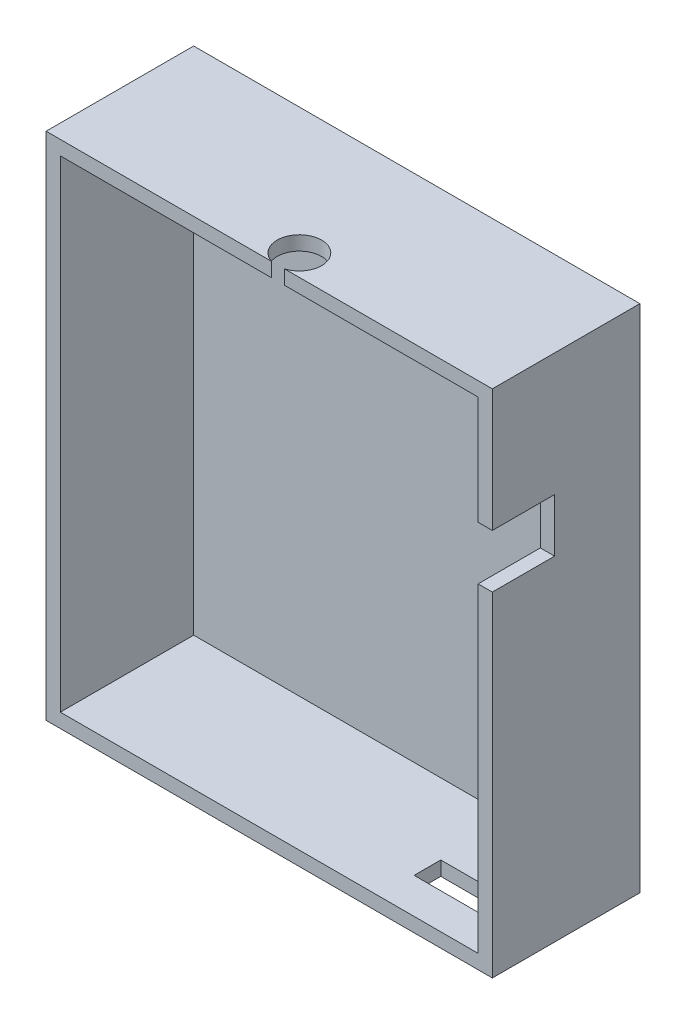
ISO-10303-21;
HEADER;
FILE_DESCRIPTION(('STEP AP214'),'2;1');
FILE_NAME('part.step','',(''),(''),'','','');
FILE_SCHEMA(('AUTOMOTIVE_DESIGN { 1 0 10303 214 1 1 1 1 }'));
ENDSEC;
DATA;
#1=APPLICATION_CONTEXT('core data for automotive mechanical design processes');
#2=APPLICATION_PROTOCOL_DEFINITION('international standard','automotive_design',2000,#1);
#3=PRODUCT_CONTEXT('',#1,'mechanical');
#4=PRODUCT('Part','Part','',(#3));
#5=PRODUCT_RELATED_PRODUCT_CATEGORY('part','',(#4));
#6=PRODUCT_DEFINITION_FORMATION('','',#4);
#7=PRODUCT_DEFINITION_CONTEXT('part definition',#1,'design');
#8=PRODUCT_DEFINITION('design','',#6,#7);
#9=PRODUCT_DEFINITION_SHAPE('','',#8);
#10=(LENGTH_UNIT() NAMED_UNIT(*) SI_UNIT(.MILLI.,.METRE.));
#11=(NAMED_UNIT(*) PLANE_ANGLE_UNIT() SI_UNIT($,.RADIAN.));
#12=(NAMED_UNIT(*) SI_UNIT($,.STERADIAN.) SOLID_ANGLE_UNIT());
#13=UNCERTAINTY_MEASURE_WITH_UNIT(LENGTH_MEASURE(1.E-05),#10,'distance_accuracy_value','');
#14=(GEOMETRIC_REPRESENTATION_CONTEXT(3) GLOBAL_UNCERTAINTY_ASSIGNED_CONTEXT((#13)) GLOBAL_UNIT_ASSIGNED_CONTEXT((#10,
#11,#12)) REPRESENTATION_CONTEXT('',''));
#15=CARTESIAN_POINT('',(0.,0.,0.));
#16=DIRECTION('',(0.,0.,1.));
#17=DIRECTION('',(1.,0.,0.));
#18=AXIS2_PLACEMENT_3D('',#15,#16,#17);
#19=CARTESIAN_POINT('',(0.,0.,16.6));
#20=DIRECTION('',(0.,0.,-1.));
#21=DIRECTION('',(-1.,0.,0.));
#22=AXIS2_PLACEMENT_3D('',#19,#20,#21);
#23=PLANE('',#22);
#24=DIRECTION('',(-1.,0.,0.));
#25=VECTOR('',#24,1.);
#26=CARTESIAN_POINT('',(0.,21.1982532751092,16.6));
#27=LINE('',#26,#25);
#28=CARTESIAN_POINT('',(25.3782131545931,21.1982532751092,16.6));
#29=VERTEX_POINT('',#28);
#30=CARTESIAN_POINT('',(1.6,21.1982532751092,16.6));
#31=VERTEX_POINT('',#30);
#32=EDGE_CURVE('E245',#29,#31,#27,.T.);
#33=ORIENTED_EDGE('',*,*,#32,.F.);
#34=DIRECTION('',(0.,1.,0.));
#35=VECTOR('',#34,1.);
#36=CARTESIAN_POINT('',(25.3782131545931,6.19825327510917,16.6));
#37=LINE('',#36,#35);
#38=CARTESIAN_POINT('',(25.3782131545931,22.7982532751092,16.6));
#39=VERTEX_POINT('',#38);
#40=EDGE_CURVE('E50',#29,#39,#37,.T.);
#41=ORIENTED_EDGE('',*,*,#40,.T.);
#42=DIRECTION('',(-1.,0.,0.));
#43=VECTOR('',#42,1.);
#44=CARTESIAN_POINT('',(0.,22.7982532751092,16.6));
#45=LINE('',#44,#43);
#46=CARTESIAN_POINT('',(0.,22.7982532751092,16.6));
#47=VERTEX_POINT('',#46);
#48=EDGE_CURVE('E174',#39,#47,#45,.T.);
#49=ORIENTED_EDGE('',*,*,#48,.T.);
#50=DIRECTION('',(0.,-1.,0.));
#51=VECTOR('',#50,1.);
#52=CARTESIAN_POINT('',(0.,-34.6017467248908,16.6));
#53=LINE('',#52,#51);
#54=CARTESIAN_POINT('',(0.,-34.6017467248908,16.6));
#55=VERTEX_POINT('',#54);
#56=EDGE_CURVE('E198',#47,#55,#53,.T.);
#57=ORIENTED_EDGE('',*,*,#56,.T.);
#58=DIRECTION('',(1.,0.,0.));
#59=VECTOR('',#58,1.);
#60=CARTESIAN_POINT('',(0.,-34.6017467248908,16.6));
#61=LINE('',#60,#59);
#62=CARTESIAN_POINT('',(50.2,-34.6017467248908,16.6));
#63=VERTEX_POINT('',#62);
#64=EDGE_CURVE('E256',#55,#63,#61,.T.);
#65=ORIENTED_EDGE('',*,*,#64,.T.);
#66=DIRECTION('',(0.,1.,0.));
#67=VECTOR('',#66,1.);
#68=CARTESIAN_POINT('',(50.2,-34.6017467248908,16.6));
#69=LINE('',#68,#67);
#70=CARTESIAN_POINT('',(50.2,2.99825327510917,16.6));
#71=VERTEX_POINT('',#70);
#72=EDGE_CURVE('E185',#63,#71,#69,.T.);
#73=ORIENTED_EDGE('',*,*,#72,.T.);
#74=DIRECTION('',(-1.,0.,0.));
#75=VECTOR('',#74,1.);
#76=CARTESIAN_POINT('',(0.,2.99825327510917,16.6));
#77=LINE('',#76,#75);
#78=CARTESIAN_POINT('',(48.6,2.99825327510917,16.6));
#79=VERTEX_POINT('',#78);
#80=EDGE_CURVE('E225',#71,#79,#77,.T.);
#81=ORIENTED_EDGE('',*,*,#80,.T.);
#82=DIRECTION('',(0.,1.,0.));
#83=VECTOR('',#82,1.);
#84=CARTESIAN_POINT('',(48.6,0.,16.6));
#85=LINE('',#84,#83);
#86=CARTESIAN_POINT('',(48.6,-33.0017467248908,16.6));
#87=VERTEX_POINT('',#86);
#88=EDGE_CURVE('E236',#87,#79,#85,.T.);
#89=ORIENTED_EDGE('',*,*,#88,.F.);
#90=DIRECTION('',(1.,0.,0.));
#91=VECTOR('',#90,1.);
#92=CARTESIAN_POINT('',(0.,-33.0017467248908,16.6));
#93=LINE('',#92,#91);
#94=CARTESIAN_POINT('',(1.6,-33.0017467248908,16.6));
#95=VERTEX_POINT('',#94);
#96=EDGE_CURVE('E250',#95,#87,#93,.T.);
#97=ORIENTED_EDGE('',*,*,#96,.F.);
#98=DIRECTION('',(0.,-1.,0.));
#99=VECTOR('',#98,1.);
#100=CARTESIAN_POINT('',(1.6,0.,16.6));
#101=LINE('',#100,#99);
#102=EDGE_CURVE('E314',#31,#95,#101,.T.);
#103=ORIENTED_EDGE('',*,*,#102,.F.);
#104=EDGE_LOOP('',(#33,#41,#49,#57,#65,#73,#81,#89,#97,#103));
#105=FACE_BOUND('',#104,.T.);
#106=ADVANCED_FACE('F36',(#105),#23,.F.);
#107=CARTESIAN_POINT('',(50.2,22.7982532751092,16.6));
#108=VERTEX_POINT('',#107);
#109=CARTESIAN_POINT('',(26.8217868454069,22.7982532751092,16.6));
#110=VERTEX_POINT('',#109);
#111=EDGE_CURVE('E172',#108,#110,#45,.T.);
#112=ORIENTED_EDGE('',*,*,#111,.T.);
#113=DIRECTION('',(0.,1.,0.));
#114=VECTOR('',#113,1.);
#115=CARTESIAN_POINT('',(26.8217868454069,6.19825327510917,16.6));
#116=LINE('',#115,#114);
#117=CARTESIAN_POINT('',(26.8217868454069,21.1982532751092,16.6));
#118=VERTEX_POINT('',#117);
#119=EDGE_CURVE('E158',#110,#118,#116,.F.);
#120=ORIENTED_EDGE('',*,*,#119,.T.);
#121=CARTESIAN_POINT('',(48.6,21.1982532751092,16.6));
#122=VERTEX_POINT('',#121);
#123=EDGE_CURVE('E248',#122,#118,#27,.T.);
#124=ORIENTED_EDGE('',*,*,#123,.F.);
#125=CARTESIAN_POINT('',(48.6,8.99825327510917,16.6));
#126=VERTEX_POINT('',#125);
#127=EDGE_CURVE('E246',#126,#122,#85,.T.);
#128=ORIENTED_EDGE('',*,*,#127,.F.);
#129=DIRECTION('',(1.,0.,0.));
#130=VECTOR('',#129,1.);
#131=CARTESIAN_POINT('',(0.,8.99825327510917,16.6));
#132=LINE('',#131,#130);
#133=CARTESIAN_POINT('',(50.2,8.99825327510917,16.6));
#134=VERTEX_POINT('',#133);
#135=EDGE_CURVE('E58',#126,#134,#132,.T.);
#136=ORIENTED_EDGE('',*,*,#135,.T.);
#137=EDGE_CURVE('E178',#134,#108,#69,.T.);
#138=ORIENTED_EDGE('',*,*,#137,.T.);
#139=EDGE_LOOP('',(#112,#120,#124,#128,#136,#138));
#140=FACE_BOUND('',#139,.T.);
#141=ADVANCED_FACE('F176',(#140),#23,.F.);
#142=CARTESIAN_POINT('',(0.,-34.6017467248908,16.6));
#143=DIRECTION('',(1.,0.,0.));
#144=DIRECTION('',(0.,0.,-1.));
#145=AXIS2_PLACEMENT_3D('',#142,#143,#144);
#146=PLANE('',#145);
#147=DIRECTION('',(0.,-1.,0.));
#148=VECTOR('',#147,1.);
#149=CARTESIAN_POINT('',(0.,-34.6017467248908,0.));
#150=LINE('',#149,#148);
#151=CARTESIAN_POINT('',(0.,22.7982532751092,0.));
#152=VERTEX_POINT('',#151);
#153=CARTESIAN_POINT('',(0.,-34.6017467248908,0.));
#154=VERTEX_POINT('',#153);
#155=EDGE_CURVE('E189',#152,#154,#150,.T.);
#156=ORIENTED_EDGE('',*,*,#155,.T.);
#157=DIRECTION('',(0.,0.,-1.));
#158=VECTOR('',#157,1.);
#159=CARTESIAN_POINT('',(0.,-34.6017467248908,16.6));
#160=LINE('',#159,#158);
#161=EDGE_CURVE('E204',#55,#154,#160,.T.);
#162=ORIENTED_EDGE('',*,*,#161,.F.);
#163=ORIENTED_EDGE('',*,*,#56,.F.);
#164=DIRECTION('',(0.,0.,-1.));
#165=VECTOR('',#164,1.);
#166=CARTESIAN_POINT('',(0.,22.7982532751092,16.6));
#167=LINE('',#166,#165);
#168=EDGE_CURVE('E180',#47,#152,#167,.T.);
#169=ORIENTED_EDGE('',*,*,#168,.T.);
#170=EDGE_LOOP('',(#156,#162,#163,#169));
#171=FACE_BOUND('',#170,.T.);
#172=ADVANCED_FACE('F38',(#171),#146,.F.);
#173=CARTESIAN_POINT('',(0.,-34.6017467248908,16.6));
#174=DIRECTION('',(0.,1.,0.));
#175=DIRECTION('',(0.,0.,1.));
#176=AXIS2_PLACEMENT_3D('',#173,#174,#175);
#177=PLANE('',#176);
#178=DIRECTION('',(1.,0.,0.));
#179=VECTOR('',#178,1.);
#180=CARTESIAN_POINT('',(37.4,-34.6017467248908,9.6));
#181=LINE('',#180,#179);
#182=CARTESIAN_POINT('',(37.4,-34.6017467248908,9.6));
#183=VERTEX_POINT('',#182);
#184=CARTESIAN_POINT('',(46.,-34.6017467248908,9.6));
#185=VERTEX_POINT('',#184);
#186=EDGE_CURVE('E280',#183,#185,#181,.T.);
#187=ORIENTED_EDGE('',*,*,#186,.F.);
#188=DIRECTION('',(0.,0.,-1.));
#189=VECTOR('',#188,1.);
#190=CARTESIAN_POINT('',(37.4,-34.6017467248908,12.6));
#191=LINE('',#190,#189);
#192=CARTESIAN_POINT('',(37.4,-34.6017467248908,12.6));
#193=VERTEX_POINT('',#192);
#194=EDGE_CURVE('E238',#193,#183,#191,.T.);
#195=ORIENTED_EDGE('',*,*,#194,.F.);
#196=DIRECTION('',(-1.,0.,0.));
#197=VECTOR('',#196,1.);
#198=CARTESIAN_POINT('',(37.4,-34.6017467248908,12.6));
#199=LINE('',#198,#197);
#200=CARTESIAN_POINT('',(46.,-34.6017467248908,12.6));
#201=VERTEX_POINT('',#200);
#202=EDGE_CURVE('E286',#201,#193,#199,.T.);
#203=ORIENTED_EDGE('',*,*,#202,.F.);
#204=DIRECTION('',(0.,0.,1.));
#205=VECTOR('',#204,1.);
#206=CARTESIAN_POINT('',(46.,-34.6017467248908,12.6));
#207=LINE('',#206,#205);
#208=EDGE_CURVE('E283',#185,#201,#207,.T.);
#209=ORIENTED_EDGE('',*,*,#208,.F.);
#210=EDGE_LOOP('',(#187,#195,#203,#209));
#211=FACE_BOUND('',#210,.T.);
#212=DIRECTION('',(1.,0.,0.));
#213=VECTOR('',#212,1.);
#214=CARTESIAN_POINT('',(0.,-34.6017467248908,0.));
#215=LINE('',#214,#213);
#216=CARTESIAN_POINT('',(50.2,-34.6017467248908,0.));
#217=VERTEX_POINT('',#216);
#218=EDGE_CURVE('E192',#154,#217,#215,.T.);
#219=ORIENTED_EDGE('',*,*,#218,.T.);
#220=DIRECTION('',(0.,0.,-1.));
#221=VECTOR('',#220,1.);
#222=CARTESIAN_POINT('',(50.2,-34.6017467248908,16.6));
#223=LINE('',#222,#221);
#224=EDGE_CURVE('E201',#63,#217,#223,.T.);
#225=ORIENTED_EDGE('',*,*,#224,.F.);
#226=ORIENTED_EDGE('',*,*,#64,.F.);
#227=ORIENTED_EDGE('',*,*,#161,.T.);
#228=EDGE_LOOP('',(#219,#225,#226,#227));
#229=FACE_BOUND('',#228,.T.);
#230=ADVANCED_FACE('F261',(#211,#229),#177,.F.);
#231=CARTESIAN_POINT('',(50.2,-34.6017467248908,16.6));
#232=DIRECTION('',(-1.,0.,0.));
#233=DIRECTION('',(0.,0.,1.));
#234=AXIS2_PLACEMENT_3D('',#231,#232,#233);
#235=PLANE('',#234);
#236=DIRECTION('',(0.,1.,0.));
#237=VECTOR('',#236,1.);
#238=CARTESIAN_POINT('',(50.2,2.99825327510917,9.6));
#239=LINE('',#238,#237);
#240=CARTESIAN_POINT('',(50.2,2.99825327510917,9.6));
#241=VERTEX_POINT('',#240);
#242=CARTESIAN_POINT('',(50.2,8.99825327510917,9.6));
#243=VERTEX_POINT('',#242);
#244=EDGE_CURVE('E269',#241,#243,#239,.T.);
#245=ORIENTED_EDGE('',*,*,#244,.F.);
#246=DIRECTION('',(0.,0.,-1.));
#247=VECTOR('',#246,1.);
#248=CARTESIAN_POINT('',(50.2,2.99825327510917,9.6));
#249=LINE('',#248,#247);
#250=EDGE_CURVE('E266',#71,#241,#249,.T.);
#251=ORIENTED_EDGE('',*,*,#250,.F.);
#252=ORIENTED_EDGE('',*,*,#72,.F.);
#253=ORIENTED_EDGE('',*,*,#224,.T.);
#254=DIRECTION('',(0.,1.,0.));
#255=VECTOR('',#254,1.);
#256=CARTESIAN_POINT('',(50.2,-34.6017467248908,0.));
#257=LINE('',#256,#255);
#258=CARTESIAN_POINT('',(50.2,22.7982532751092,0.));
#259=VERTEX_POINT('',#258);
#260=EDGE_CURVE('E195',#217,#259,#257,.T.);
#261=ORIENTED_EDGE('',*,*,#260,.T.);
#262=DIRECTION('',(0.,0.,-1.));
#263=VECTOR('',#262,1.);
#264=CARTESIAN_POINT('',(50.2,22.7982532751092,16.6));
#265=LINE('',#264,#263);
#266=EDGE_CURVE('E183',#108,#259,#265,.T.);
#267=ORIENTED_EDGE('',*,*,#266,.F.);
#268=ORIENTED_EDGE('',*,*,#137,.F.);
#269=DIRECTION('',(0.,0.,1.));
#270=VECTOR('',#269,1.);
#271=CARTESIAN_POINT('',(50.2,8.99825327510917,9.6));
#272=LINE('',#271,#270);
#273=EDGE_CURVE('E271',#243,#134,#272,.T.);
#274=ORIENTED_EDGE('',*,*,#273,.F.);
#275=EDGE_LOOP('',(#245,#251,#252,#253,#261,#267,#268,#274));
#276=FACE_BOUND('',#275,.T.);
#277=ADVANCED_FACE('F265',(#276),#235,.F.);
#278=CARTESIAN_POINT('',(0.,22.7982532751092,16.6));
#279=DIRECTION('',(0.,-1.,0.));
#280=DIRECTION('',(0.,0.,-1.));
#281=AXIS2_PLACEMENT_3D('',#278,#279,#280);
#282=PLANE('',#281);
#283=ORIENTED_EDGE('',*,*,#48,.F.);
#284=CARTESIAN_POINT('',(26.1,22.7982532751092,14.2064620851556));
#285=DIRECTION('',(0.,1.,0.));
#286=DIRECTION('',(0.,0.,1.));
#287=AXIS2_PLACEMENT_3D('',#284,#285,#286);
#288=CIRCLE('',#287,2.5);
#289=EDGE_CURVE('E161',#110,#39,#288,.T.);
#290=ORIENTED_EDGE('',*,*,#289,.F.);
#291=ORIENTED_EDGE('',*,*,#111,.F.);
#292=ORIENTED_EDGE('',*,*,#266,.T.);
#293=DIRECTION('',(-1.,0.,0.));
#294=VECTOR('',#293,1.);
#295=CARTESIAN_POINT('',(0.,22.7982532751092,0.));
#296=LINE('',#295,#294);
#297=EDGE_CURVE('E197',#259,#152,#296,.T.);
#298=ORIENTED_EDGE('',*,*,#297,.T.);
#299=ORIENTED_EDGE('',*,*,#168,.F.);
#300=EDGE_LOOP('',(#283,#290,#291,#292,#298,#299));
#301=FACE_BOUND('',#300,.T.);
#302=ADVANCED_FACE('F170',(#301),#282,.F.);
#303=CARTESIAN_POINT('',(0.,0.,0.));
#304=DIRECTION('',(0.,0.,-1.));
#305=DIRECTION('',(-1.,0.,0.));
#306=AXIS2_PLACEMENT_3D('',#303,#304,#305);
#307=PLANE('',#306);
#308=ORIENTED_EDGE('',*,*,#155,.F.);
#309=ORIENTED_EDGE('',*,*,#297,.F.);
#310=ORIENTED_EDGE('',*,*,#260,.F.);
#311=ORIENTED_EDGE('',*,*,#218,.F.);
#312=EDGE_LOOP('',(#308,#309,#310,#311));
#313=FACE_BOUND('',#312,.T.);
#314=ADVANCED_FACE('F337',(#313),#307,.T.);
#315=CARTESIAN_POINT('',(1.6,-34.6017467248908,16.6));
#316=DIRECTION('',(1.,0.,0.));
#317=DIRECTION('',(0.,0.,-1.));
#318=AXIS2_PLACEMENT_3D('',#315,#316,#317);
#319=PLANE('',#318);
#320=DIRECTION('',(0.,-1.,0.));
#321=VECTOR('',#320,1.);
#322=CARTESIAN_POINT('',(1.6,0.,1.6));
#323=LINE('',#322,#321);
#324=CARTESIAN_POINT('',(1.6,21.1982532751092,1.6));
#325=VERTEX_POINT('',#324);
#326=CARTESIAN_POINT('',(1.6,-33.0017467248908,1.6));
#327=VERTEX_POINT('',#326);
#328=EDGE_CURVE('E292',#325,#327,#323,.T.);
#329=ORIENTED_EDGE('',*,*,#328,.F.);
#330=DIRECTION('',(0.,0.,-1.));
#331=VECTOR('',#330,1.);
#332=CARTESIAN_POINT('',(1.6,21.1982532751092,16.6));
#333=LINE('',#332,#331);
#334=EDGE_CURVE('E254',#31,#325,#333,.T.);
#335=ORIENTED_EDGE('',*,*,#334,.F.);
#336=ORIENTED_EDGE('',*,*,#102,.T.);
#337=DIRECTION('',(0.,0.,-1.));
#338=VECTOR('',#337,1.);
#339=CARTESIAN_POINT('',(1.6,-33.0017467248908,16.6));
#340=LINE('',#339,#338);
#341=EDGE_CURVE('E193',#95,#327,#340,.T.);
#342=ORIENTED_EDGE('',*,*,#341,.T.);
#343=EDGE_LOOP('',(#329,#335,#336,#342));
#344=FACE_BOUND('',#343,.T.);
#345=ADVANCED_FACE('F325',(#344),#319,.T.);
#346=CARTESIAN_POINT('',(0.,-33.0017467248908,16.6));
#347=DIRECTION('',(0.,1.,0.));
#348=DIRECTION('',(0.,0.,1.));
#349=AXIS2_PLACEMENT_3D('',#346,#347,#348);
#350=PLANE('',#349);
#351=DIRECTION('',(0.,0.,1.));
#352=VECTOR('',#351,1.);
#353=CARTESIAN_POINT('',(37.4,-33.0017467248908,16.6));
#354=LINE('',#353,#352);
#355=CARTESIAN_POINT('',(37.4,-33.0017467248908,9.6));
#356=VERTEX_POINT('',#355);
#357=CARTESIAN_POINT('',(37.4,-33.0017467248908,12.6));
#358=VERTEX_POINT('',#357);
#359=EDGE_CURVE('E214',#356,#358,#354,.T.);
#360=ORIENTED_EDGE('',*,*,#359,.F.);
#361=DIRECTION('',(-1.,0.,0.));
#362=VECTOR('',#361,1.);
#363=CARTESIAN_POINT('',(0.,-33.0017467248908,9.59999999999999));
#364=LINE('',#363,#362);
#365=CARTESIAN_POINT('',(46.,-33.0017467248908,9.6));
#366=VERTEX_POINT('',#365);
#367=EDGE_CURVE('E207',#366,#356,#364,.T.);
#368=ORIENTED_EDGE('',*,*,#367,.F.);
#369=DIRECTION('',(0.,0.,-1.));
#370=VECTOR('',#369,1.);
#371=CARTESIAN_POINT('',(46.,-33.0017467248908,16.6));
#372=LINE('',#371,#370);
#373=CARTESIAN_POINT('',(46.,-33.0017467248908,12.6));
#374=VERTEX_POINT('',#373);
#375=EDGE_CURVE('E209',#374,#366,#372,.T.);
#376=ORIENTED_EDGE('',*,*,#375,.F.);
#377=DIRECTION('',(1.,0.,0.));
#378=VECTOR('',#377,1.);
#379=CARTESIAN_POINT('',(0.,-33.0017467248908,12.6));
#380=LINE('',#379,#378);
#381=EDGE_CURVE('E212',#358,#374,#380,.T.);
#382=ORIENTED_EDGE('',*,*,#381,.F.);
#383=EDGE_LOOP('',(#360,#368,#376,#382));
#384=FACE_BOUND('',#383,.T.);
#385=DIRECTION('',(1.,0.,0.));
#386=VECTOR('',#385,1.);
#387=CARTESIAN_POINT('',(0.,-33.0017467248908,1.6));
#388=LINE('',#387,#386);
#389=CARTESIAN_POINT('',(48.6,-33.0017467248908,1.6));
#390=VERTEX_POINT('',#389);
#391=EDGE_CURVE('E301',#327,#390,#388,.T.);
#392=ORIENTED_EDGE('',*,*,#391,.F.);
#393=ORIENTED_EDGE('',*,*,#341,.F.);
#394=ORIENTED_EDGE('',*,*,#96,.T.);
#395=DIRECTION('',(0.,0.,-1.));
#396=VECTOR('',#395,1.);
#397=CARTESIAN_POINT('',(48.6,-33.0017467248908,16.6));
#398=LINE('',#397,#396);
#399=EDGE_CURVE('E244',#87,#390,#398,.T.);
#400=ORIENTED_EDGE('',*,*,#399,.T.);
#401=EDGE_LOOP('',(#392,#393,#394,#400));
#402=FACE_BOUND('',#401,.T.);
#403=ADVANCED_FACE('F320',(#384,#402),#350,.T.);
#404=CARTESIAN_POINT('',(48.6,-34.6017467248908,16.6));
#405=DIRECTION('',(-1.,0.,0.));
#406=DIRECTION('',(0.,0.,1.));
#407=AXIS2_PLACEMENT_3D('',#404,#405,#406);
#408=PLANE('',#407);
#409=DIRECTION('',(0.,0.,1.));
#410=VECTOR('',#409,1.);
#411=CARTESIAN_POINT('',(48.6,2.99825327510917,16.6));
#412=LINE('',#411,#410);
#413=CARTESIAN_POINT('',(48.6,2.99825327510917,9.6));
#414=VERTEX_POINT('',#413);
#415=EDGE_CURVE('E44',#414,#79,#412,.T.);
#416=ORIENTED_EDGE('',*,*,#415,.F.);
#417=DIRECTION('',(0.,-1.,0.));
#418=VECTOR('',#417,1.);
#419=CARTESIAN_POINT('',(48.6,-34.6017467248908,9.6));
#420=LINE('',#419,#418);
#421=CARTESIAN_POINT('',(48.6,8.99825327510917,9.6));
#422=VERTEX_POINT('',#421);
#423=EDGE_CURVE('E218',#422,#414,#420,.T.);
#424=ORIENTED_EDGE('',*,*,#423,.F.);
#425=DIRECTION('',(0.,0.,-1.));
#426=VECTOR('',#425,1.);
#427=CARTESIAN_POINT('',(48.6,8.99825327510917,16.6));
#428=LINE('',#427,#426);
#429=EDGE_CURVE('E216',#126,#422,#428,.T.);
#430=ORIENTED_EDGE('',*,*,#429,.F.);
#431=ORIENTED_EDGE('',*,*,#127,.T.);
#432=DIRECTION('',(0.,0.,-1.));
#433=VECTOR('',#432,1.);
#434=CARTESIAN_POINT('',(48.6,21.1982532751092,16.6));
#435=LINE('',#434,#433);
#436=CARTESIAN_POINT('',(48.6,21.1982532751092,1.6));
#437=VERTEX_POINT('',#436);
#438=EDGE_CURVE('E306',#122,#437,#435,.T.);
#439=ORIENTED_EDGE('',*,*,#438,.T.);
#440=DIRECTION('',(0.,1.,0.));
#441=VECTOR('',#440,1.);
#442=CARTESIAN_POINT('',(48.6,0.,1.6));
#443=LINE('',#442,#441);
#444=EDGE_CURVE('E308',#390,#437,#443,.T.);
#445=ORIENTED_EDGE('',*,*,#444,.F.);
#446=ORIENTED_EDGE('',*,*,#399,.F.);
#447=ORIENTED_EDGE('',*,*,#88,.T.);
#448=EDGE_LOOP('',(#416,#424,#430,#431,#439,#445,#446,#447));
#449=FACE_BOUND('',#448,.T.);
#450=ADVANCED_FACE('F241',(#449),#408,.T.);
#451=CARTESIAN_POINT('',(0.,21.1982532751092,16.6));
#452=DIRECTION('',(0.,-1.,0.));
#453=DIRECTION('',(0.,0.,-1.));
#454=AXIS2_PLACEMENT_3D('',#451,#452,#453);
#455=PLANE('',#454);
#456=CARTESIAN_POINT('',(26.1,21.1982532751092,14.2064620851556));
#457=DIRECTION('',(0.,-1.,0.));
#458=DIRECTION('',(0.,0.,-1.));
#459=AXIS2_PLACEMENT_3D('',#456,#457,#458);
#460=CIRCLE('',#459,2.5);
#461=EDGE_CURVE('E11',#29,#118,#460,.T.);
#462=ORIENTED_EDGE('',*,*,#461,.F.);
#463=ORIENTED_EDGE('',*,*,#32,.T.);
#464=ORIENTED_EDGE('',*,*,#334,.T.);
#465=DIRECTION('',(-1.,0.,0.));
#466=VECTOR('',#465,1.);
#467=CARTESIAN_POINT('',(0.,21.1982532751092,1.6));
#468=LINE('',#467,#466);
#469=EDGE_CURVE('E311',#437,#325,#468,.T.);
#470=ORIENTED_EDGE('',*,*,#469,.F.);
#471=ORIENTED_EDGE('',*,*,#438,.F.);
#472=ORIENTED_EDGE('',*,*,#123,.T.);
#473=EDGE_LOOP('',(#462,#463,#464,#470,#471,#472));
#474=FACE_BOUND('',#473,.T.);
#475=ADVANCED_FACE('F322',(#474),#455,.T.);
#476=CARTESIAN_POINT('',(0.,0.,1.6));
#477=DIRECTION('',(0.,0.,-1.));
#478=DIRECTION('',(-1.,0.,0.));
#479=AXIS2_PLACEMENT_3D('',#476,#477,#478);
#480=PLANE('',#479);
#481=ORIENTED_EDGE('',*,*,#328,.T.);
#482=ORIENTED_EDGE('',*,*,#391,.T.);
#483=ORIENTED_EDGE('',*,*,#444,.T.);
#484=ORIENTED_EDGE('',*,*,#469,.T.);
#485=EDGE_LOOP('',(#481,#482,#483,#484));
#486=FACE_BOUND('',#485,.T.);
#487=ADVANCED_FACE('F327',(#486),#480,.F.);
#488=CARTESIAN_POINT('',(37.4,-18.0017467248908,12.6));
#489=DIRECTION('',(-1.,0.,0.));
#490=DIRECTION('',(0.,0.,1.));
#491=AXIS2_PLACEMENT_3D('',#488,#489,#490);
#492=PLANE('',#491);
#493=ORIENTED_EDGE('',*,*,#359,.T.);
#494=DIRECTION('',(0.,-1.,0.));
#495=VECTOR('',#494,1.);
#496=CARTESIAN_POINT('',(37.4,-18.0017467248908,12.6));
#497=LINE('',#496,#495);
#498=EDGE_CURVE('E290',#358,#193,#497,.T.);
#499=ORIENTED_EDGE('',*,*,#498,.T.);
#500=ORIENTED_EDGE('',*,*,#194,.T.);
#501=DIRECTION('',(0.,-1.,0.));
#502=VECTOR('',#501,1.);
#503=CARTESIAN_POINT('',(37.4,-18.0017467248908,9.6));
#504=LINE('',#503,#502);
#505=EDGE_CURVE('E289',#356,#183,#504,.T.);
#506=ORIENTED_EDGE('',*,*,#505,.F.);
#507=EDGE_LOOP('',(#493,#499,#500,#506));
#508=FACE_BOUND('',#507,.T.);
#509=ADVANCED_FACE('F404',(#508),#492,.F.);
#510=CARTESIAN_POINT('',(37.4,-18.0017467248908,12.6));
#511=DIRECTION('',(0.,0.,1.));
#512=DIRECTION('',(1.,0.,0.));
#513=AXIS2_PLACEMENT_3D('',#510,#511,#512);
#514=PLANE('',#513);
#515=ORIENTED_EDGE('',*,*,#381,.T.);
#516=DIRECTION('',(0.,-1.,0.));
#517=VECTOR('',#516,1.);
#518=CARTESIAN_POINT('',(46.,-18.0017467248908,12.6));
#519=LINE('',#518,#517);
#520=EDGE_CURVE('E293',#374,#201,#519,.T.);
#521=ORIENTED_EDGE('',*,*,#520,.T.);
#522=ORIENTED_EDGE('',*,*,#202,.T.);
#523=ORIENTED_EDGE('',*,*,#498,.F.);
#524=EDGE_LOOP('',(#515,#521,#522,#523));
#525=FACE_BOUND('',#524,.T.);
#526=ADVANCED_FACE('F409',(#525),#514,.F.);
#527=CARTESIAN_POINT('',(46.,-18.0017467248908,12.6));
#528=DIRECTION('',(1.,0.,0.));
#529=DIRECTION('',(0.,0.,-1.));
#530=AXIS2_PLACEMENT_3D('',#527,#528,#529);
#531=PLANE('',#530);
#532=ORIENTED_EDGE('',*,*,#375,.T.);
#533=DIRECTION('',(0.,-1.,0.));
#534=VECTOR('',#533,1.);
#535=CARTESIAN_POINT('',(46.,-18.0017467248908,9.6));
#536=LINE('',#535,#534);
#537=EDGE_CURVE('E295',#366,#185,#536,.T.);
#538=ORIENTED_EDGE('',*,*,#537,.T.);
#539=ORIENTED_EDGE('',*,*,#208,.T.);
#540=ORIENTED_EDGE('',*,*,#520,.F.);
#541=EDGE_LOOP('',(#532,#538,#539,#540));
#542=FACE_BOUND('',#541,.T.);
#543=ADVANCED_FACE('F417',(#542),#531,.F.);
#544=CARTESIAN_POINT('',(37.4,-18.0017467248908,9.6));
#545=DIRECTION('',(0.,0.,-1.));
#546=DIRECTION('',(-1.,0.,0.));
#547=AXIS2_PLACEMENT_3D('',#544,#545,#546);
#548=PLANE('',#547);
#549=ORIENTED_EDGE('',*,*,#367,.T.);
#550=ORIENTED_EDGE('',*,*,#505,.T.);
#551=ORIENTED_EDGE('',*,*,#186,.T.);
#552=ORIENTED_EDGE('',*,*,#537,.F.);
#553=EDGE_LOOP('',(#549,#550,#551,#552));
#554=FACE_BOUND('',#553,.T.);
#555=ADVANCED_FACE('F425',(#554),#548,.F.);
#556=CARTESIAN_POINT('',(33.6,2.99825327510917,9.6));
#557=DIRECTION('',(0.,-1.,0.));
#558=DIRECTION('',(0.,0.,-1.));
#559=AXIS2_PLACEMENT_3D('',#556,#557,#558);
#560=PLANE('',#559);
#561=ORIENTED_EDGE('',*,*,#250,.T.);
#562=DIRECTION('',(1.,0.,0.));
#563=VECTOR('',#562,1.);
#564=CARTESIAN_POINT('',(33.6,2.99825327510917,9.6));
#565=LINE('',#564,#563);
#566=EDGE_CURVE('E227',#414,#241,#565,.T.);
#567=ORIENTED_EDGE('',*,*,#566,.F.);
#568=ORIENTED_EDGE('',*,*,#415,.T.);
#569=ORIENTED_EDGE('',*,*,#80,.F.);
#570=EDGE_LOOP('',(#561,#567,#568,#569));
#571=FACE_BOUND('',#570,.T.);
#572=ADVANCED_FACE('F224',(#571),#560,.F.);
#573=CARTESIAN_POINT('',(33.6,8.99825327510917,9.6));
#574=DIRECTION('',(0.,1.,0.));
#575=DIRECTION('',(0.,0.,1.));
#576=AXIS2_PLACEMENT_3D('',#573,#574,#575);
#577=PLANE('',#576);
#578=ORIENTED_EDGE('',*,*,#429,.T.);
#579=DIRECTION('',(1.,0.,0.));
#580=VECTOR('',#579,1.);
#581=CARTESIAN_POINT('',(33.6,8.99825327510917,9.6));
#582=LINE('',#581,#580);
#583=EDGE_CURVE('E270',#422,#243,#582,.T.);
#584=ORIENTED_EDGE('',*,*,#583,.T.);
#585=ORIENTED_EDGE('',*,*,#273,.T.);
#586=ORIENTED_EDGE('',*,*,#135,.F.);
#587=EDGE_LOOP('',(#578,#584,#585,#586));
#588=FACE_BOUND('',#587,.T.);
#589=ADVANCED_FACE('F331',(#588),#577,.F.);
#590=CARTESIAN_POINT('',(33.6,2.99825327510917,9.6));
#591=DIRECTION('',(0.,0.,-1.));
#592=DIRECTION('',(-1.,0.,0.));
#593=AXIS2_PLACEMENT_3D('',#590,#591,#592);
#594=PLANE('',#593);
#595=ORIENTED_EDGE('',*,*,#423,.T.);
#596=ORIENTED_EDGE('',*,*,#566,.T.);
#597=ORIENTED_EDGE('',*,*,#244,.T.);
#598=ORIENTED_EDGE('',*,*,#583,.F.);
#599=EDGE_LOOP('',(#595,#596,#597,#598));
#600=FACE_BOUND('',#599,.T.);
#601=ADVANCED_FACE('F333',(#600),#594,.F.);
#602=CARTESIAN_POINT('',(26.1,6.19825327510917,14.2064620851556));
#603=DIRECTION('',(0.,1.,0.));
#604=DIRECTION('',(0.,0.,1.));
#605=AXIS2_PLACEMENT_3D('',#602,#603,#604);
#606=CYLINDRICAL_SURFACE('',#605,2.5);
#607=ORIENTED_EDGE('',*,*,#461,.T.);
#608=ORIENTED_EDGE('',*,*,#119,.F.);
#609=ORIENTED_EDGE('',*,*,#289,.T.);
#610=ORIENTED_EDGE('',*,*,#40,.F.);
#611=EDGE_LOOP('',(#607,#608,#609,#610));
#612=FACE_BOUND('',#611,.T.);
#613=ADVANCED_FACE('F160',(#612),#606,.F.);
#614=CLOSED_SHELL('',(#106,#141,#172,#230,#277,#302,#314,#345,#403,#450,#475,#487,#509,#526,
#543,#555,#572,#589,#601,#613));
#615=MANIFOLD_SOLID_BREP('B2',#614);
#616=ADVANCED_BREP_SHAPE_REPRESENTATION('',(#18,#615),#14);
#617=SHAPE_DEFINITION_REPRESENTATION(#9,#616);
ENDSEC;
END-ISO-10303-21;
